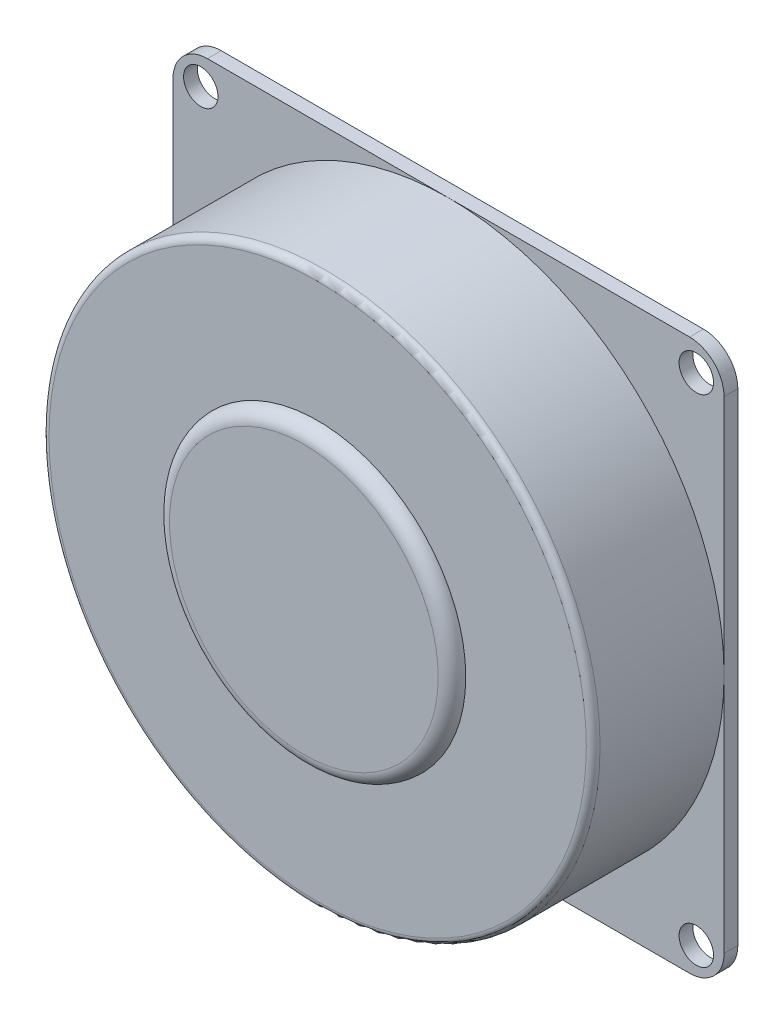
ISO-10303-21;
HEADER;
FILE_DESCRIPTION(('STEP AP214'),'2;1');
FILE_NAME('part.step','',(''),(''),'','','');
FILE_SCHEMA(('AUTOMOTIVE_DESIGN { 1 0 10303 214 1 1 1 1 }'));
ENDSEC;
DATA;
#1=APPLICATION_CONTEXT('core data for automotive mechanical design processes');
#2=APPLICATION_PROTOCOL_DEFINITION('international standard','automotive_design',2000,#1);
#3=PRODUCT_CONTEXT('',#1,'mechanical');
#4=PRODUCT('Part','Part','',(#3));
#5=PRODUCT_RELATED_PRODUCT_CATEGORY('part','',(#4));
#6=PRODUCT_DEFINITION_FORMATION('','',#4);
#7=PRODUCT_DEFINITION_CONTEXT('part definition',#1,'design');
#8=PRODUCT_DEFINITION('design','',#6,#7);
#9=PRODUCT_DEFINITION_SHAPE('','',#8);
#10=(LENGTH_UNIT() NAMED_UNIT(*) SI_UNIT(.MILLI.,.METRE.));
#11=(NAMED_UNIT(*) PLANE_ANGLE_UNIT() SI_UNIT($,.RADIAN.));
#12=(NAMED_UNIT(*) SI_UNIT($,.STERADIAN.) SOLID_ANGLE_UNIT());
#13=UNCERTAINTY_MEASURE_WITH_UNIT(LENGTH_MEASURE(1.E-05),#10,'distance_accuracy_value','');
#14=(GEOMETRIC_REPRESENTATION_CONTEXT(3) GLOBAL_UNCERTAINTY_ASSIGNED_CONTEXT((#13)) GLOBAL_UNIT_ASSIGNED_CONTEXT((#10,
#11,#12)) REPRESENTATION_CONTEXT('',''));
#15=CARTESIAN_POINT('',(0.,0.,0.));
#16=DIRECTION('',(0.,0.,1.));
#17=DIRECTION('',(1.,0.,0.));
#18=AXIS2_PLACEMENT_3D('',#15,#16,#17);
#19=CARTESIAN_POINT('',(0.,0.,2.));
#20=DIRECTION('',(0.,0.,1.));
#21=DIRECTION('',(1.,0.,0.));
#22=AXIS2_PLACEMENT_3D('',#19,#20,#21);
#23=PLANE('',#22);
#24=DIRECTION('',(0.,1.,0.));
#25=VECTOR('',#24,1.);
#26=CARTESIAN_POINT('',(45.6336839540974,33.784355179704,2.));
#27=LINE('',#26,#25);
#28=CARTESIAN_POINT('',(45.6336839540974,-6.21564482029598,2.));
#29=VERTEX_POINT('',#28);
#30=CARTESIAN_POINT('',(45.6336839540974,28.784355179704,2.));
#31=VERTEX_POINT('',#30);
#32=EDGE_CURVE('E141',#29,#31,#27,.T.);
#33=ORIENTED_EDGE('',*,*,#32,.T.);
#34=CARTESIAN_POINT('',(40.6336839540974,28.784355179704,2.));
#35=DIRECTION('',(0.,0.,1.));
#36=DIRECTION('',(1.,0.,0.));
#37=AXIS2_PLACEMENT_3D('',#34,#35,#36);
#38=CIRCLE('',#37,5.);
#39=CARTESIAN_POINT('',(40.6336839540974,33.784355179704,2.));
#40=VERTEX_POINT('',#39);
#41=EDGE_CURVE('E61',#31,#40,#38,.T.);
#42=ORIENTED_EDGE('',*,*,#41,.T.);
#43=DIRECTION('',(-1.,0.,0.));
#44=VECTOR('',#43,1.);
#45=CARTESIAN_POINT('',(-34.3663160459026,33.784355179704,2.));
#46=LINE('',#45,#44);
#47=CARTESIAN_POINT('',(5.63368395409738,33.784355179704,2.));
#48=VERTEX_POINT('',#47);
#49=EDGE_CURVE('E153',#40,#48,#46,.T.);
#50=ORIENTED_EDGE('',*,*,#49,.T.);
#51=CARTESIAN_POINT('',(5.63368395409738,-6.21564482029598,2.));
#52=DIRECTION('',(0.,0.,1.));
#53=DIRECTION('',(1.,0.,0.));
#54=AXIS2_PLACEMENT_3D('',#51,#52,#53);
#55=CIRCLE('',#54,40.);
#56=EDGE_CURVE('E151',#29,#48,#55,.T.);
#57=ORIENTED_EDGE('',*,*,#56,.F.);
#58=EDGE_LOOP('',(#33,#42,#50,#57));
#59=FACE_BOUND('',#58,.T.);
#60=CARTESIAN_POINT('',(41.604922999505,29.784355179704,2.));
#61=DIRECTION('',(0.,0.,1.));
#62=DIRECTION('',(-1.,0.,0.));
#63=AXIS2_PLACEMENT_3D('',#60,#61,#62);
#64=CIRCLE('',#63,2.49999999999999);
#65=CARTESIAN_POINT('',(39.1049229995051,29.784355179704,2.));
#66=VERTEX_POINT('',#65);
#67=EDGE_CURVE('E172',#66,#66,#64,.T.);
#68=ORIENTED_EDGE('',*,*,#67,.F.);
#69=EDGE_LOOP('',(#68));
#70=FACE_BOUND('',#69,.T.);
#71=ADVANCED_FACE('F45',(#59,#70),#23,.T.);
#72=CARTESIAN_POINT('',(-29.3663160459026,33.784355179704,2.));
#73=VERTEX_POINT('',#72);
#74=EDGE_CURVE('E140',#48,#73,#46,.T.);
#75=ORIENTED_EDGE('',*,*,#74,.T.);
#76=CARTESIAN_POINT('',(-29.3663160459026,28.784355179704,2.));
#77=DIRECTION('',(0.,0.,1.));
#78=DIRECTION('',(1.,0.,0.));
#79=AXIS2_PLACEMENT_3D('',#76,#77,#78);
#80=CIRCLE('',#79,5.);
#81=CARTESIAN_POINT('',(-34.3663160459026,28.784355179704,2.));
#82=VERTEX_POINT('',#81);
#83=EDGE_CURVE('E268',#73,#82,#80,.T.);
#84=ORIENTED_EDGE('',*,*,#83,.T.);
#85=DIRECTION('',(0.,-1.,0.));
#86=VECTOR('',#85,1.);
#87=CARTESIAN_POINT('',(-34.3663160459026,33.784355179704,2.));
#88=LINE('',#87,#86);
#89=CARTESIAN_POINT('',(-34.3663160459026,-6.21564482029598,2.));
#90=VERTEX_POINT('',#89);
#91=EDGE_CURVE('E204',#82,#90,#88,.T.);
#92=ORIENTED_EDGE('',*,*,#91,.T.);
#93=EDGE_CURVE('E160',#48,#90,#55,.T.);
#94=ORIENTED_EDGE('',*,*,#93,.F.);
#95=EDGE_LOOP('',(#75,#84,#92,#94));
#96=FACE_BOUND('',#95,.T.);
#97=CARTESIAN_POINT('',(-30.3375550913103,29.784355179704,2.));
#98=DIRECTION('',(0.,0.,1.));
#99=DIRECTION('',(1.,0.,0.));
#100=AXIS2_PLACEMENT_3D('',#97,#98,#99);
#101=CIRCLE('',#100,2.5);
#102=CARTESIAN_POINT('',(-27.8375550913103,29.784355179704,2.));
#103=VERTEX_POINT('',#102);
#104=EDGE_CURVE('E196',#103,#103,#101,.T.);
#105=ORIENTED_EDGE('',*,*,#104,.F.);
#106=EDGE_LOOP('',(#105));
#107=FACE_BOUND('',#106,.T.);
#108=ADVANCED_FACE('F292',(#96,#107),#23,.T.);
#109=CARTESIAN_POINT('',(-34.3663160459026,-41.215644820296,2.));
#110=VERTEX_POINT('',#109);
#111=EDGE_CURVE('E208',#90,#110,#88,.T.);
#112=ORIENTED_EDGE('',*,*,#111,.T.);
#113=CARTESIAN_POINT('',(-29.3663160459026,-41.215644820296,2.));
#114=DIRECTION('',(0.,0.,1.));
#115=DIRECTION('',(1.,0.,0.));
#116=AXIS2_PLACEMENT_3D('',#113,#114,#115);
#117=CIRCLE('',#116,5.);
#118=CARTESIAN_POINT('',(-29.3663160459026,-46.215644820296,2.));
#119=VERTEX_POINT('',#118);
#120=EDGE_CURVE('E257',#110,#119,#117,.T.);
#121=ORIENTED_EDGE('',*,*,#120,.T.);
#122=DIRECTION('',(1.,0.,0.));
#123=VECTOR('',#122,1.);
#124=CARTESIAN_POINT('',(-34.3663160459026,-46.215644820296,2.));
#125=LINE('',#124,#123);
#126=CARTESIAN_POINT('',(5.63368395409738,-46.215644820296,2.));
#127=VERTEX_POINT('',#126);
#128=EDGE_CURVE('E149',#119,#127,#125,.T.);
#129=ORIENTED_EDGE('',*,*,#128,.T.);
#130=EDGE_CURVE('E164',#90,#127,#55,.T.);
#131=ORIENTED_EDGE('',*,*,#130,.F.);
#132=EDGE_LOOP('',(#112,#121,#129,#131));
#133=FACE_BOUND('',#132,.T.);
#134=CARTESIAN_POINT('',(-30.3375550913103,-42.215644820296,2.));
#135=DIRECTION('',(0.,0.,1.));
#136=DIRECTION('',(1.,0.,0.));
#137=AXIS2_PLACEMENT_3D('',#134,#135,#136);
#138=CIRCLE('',#137,2.5);
#139=CARTESIAN_POINT('',(-27.8375550913103,-42.215644820296,2.));
#140=VERTEX_POINT('',#139);
#141=EDGE_CURVE('E180',#140,#140,#138,.T.);
#142=ORIENTED_EDGE('',*,*,#141,.F.);
#143=EDGE_LOOP('',(#142));
#144=FACE_BOUND('',#143,.T.);
#145=ADVANCED_FACE('F298',(#133,#144),#23,.T.);
#146=CARTESIAN_POINT('',(40.6336839540974,-46.215644820296,2.));
#147=VERTEX_POINT('',#146);
#148=EDGE_CURVE('E207',#127,#147,#125,.T.);
#149=ORIENTED_EDGE('',*,*,#148,.T.);
#150=CARTESIAN_POINT('',(40.6336839540974,-41.215644820296,2.));
#151=DIRECTION('',(0.,0.,1.));
#152=DIRECTION('',(1.,0.,0.));
#153=AXIS2_PLACEMENT_3D('',#150,#151,#152);
#154=CIRCLE('',#153,5.);
#155=CARTESIAN_POINT('',(45.6336839540974,-41.215644820296,2.));
#156=VERTEX_POINT('',#155);
#157=EDGE_CURVE('E135',#147,#156,#154,.T.);
#158=ORIENTED_EDGE('',*,*,#157,.T.);
#159=EDGE_CURVE('E126',#156,#29,#27,.T.);
#160=ORIENTED_EDGE('',*,*,#159,.T.);
#161=EDGE_CURVE('E132',#127,#29,#55,.T.);
#162=ORIENTED_EDGE('',*,*,#161,.F.);
#163=EDGE_LOOP('',(#149,#158,#160,#162));
#164=FACE_BOUND('',#163,.T.);
#165=CARTESIAN_POINT('',(41.6049229995051,-42.215644820296,2.));
#166=DIRECTION('',(0.,0.,1.));
#167=DIRECTION('',(-1.,0.,0.));
#168=AXIS2_PLACEMENT_3D('',#165,#166,#167);
#169=CIRCLE('',#168,2.5);
#170=CARTESIAN_POINT('',(39.1049229995051,-42.215644820296,2.));
#171=VERTEX_POINT('',#170);
#172=EDGE_CURVE('E188',#171,#171,#169,.T.);
#173=ORIENTED_EDGE('',*,*,#172,.F.);
#174=EDGE_LOOP('',(#173));
#175=FACE_BOUND('',#174,.T.);
#176=ADVANCED_FACE('F129',(#164,#175),#23,.T.);
#177=CARTESIAN_POINT('',(0.,0.,0.));
#178=DIRECTION('',(0.,0.,1.));
#179=DIRECTION('',(1.,0.,0.));
#180=AXIS2_PLACEMENT_3D('',#177,#178,#179);
#181=PLANE('',#180);
#182=DIRECTION('',(0.,1.,0.));
#183=VECTOR('',#182,1.);
#184=CARTESIAN_POINT('',(45.6336839540974,33.784355179704,0.));
#185=LINE('',#184,#183);
#186=CARTESIAN_POINT('',(45.6336839540974,-41.215644820296,0.));
#187=VERTEX_POINT('',#186);
#188=CARTESIAN_POINT('',(45.6336839540974,28.784355179704,0.));
#189=VERTEX_POINT('',#188);
#190=EDGE_CURVE('E218',#187,#189,#185,.T.);
#191=ORIENTED_EDGE('',*,*,#190,.F.);
#192=CARTESIAN_POINT('',(40.6336839540974,-41.215644820296,0.));
#193=DIRECTION('',(0.,0.,1.));
#194=DIRECTION('',(1.,0.,0.));
#195=AXIS2_PLACEMENT_3D('',#192,#193,#194);
#196=CIRCLE('',#195,5.);
#197=CARTESIAN_POINT('',(40.6336839540974,-46.215644820296,0.));
#198=VERTEX_POINT('',#197);
#199=EDGE_CURVE('E238',#187,#198,#196,.F.);
#200=ORIENTED_EDGE('',*,*,#199,.T.);
#201=DIRECTION('',(1.,0.,0.));
#202=VECTOR('',#201,1.);
#203=CARTESIAN_POINT('',(-34.3663160459026,-46.215644820296,0.));
#204=LINE('',#203,#202);
#205=CARTESIAN_POINT('',(-29.3663160459026,-46.215644820296,0.));
#206=VERTEX_POINT('',#205);
#207=EDGE_CURVE('E214',#206,#198,#204,.T.);
#208=ORIENTED_EDGE('',*,*,#207,.F.);
#209=CARTESIAN_POINT('',(-29.3663160459026,-41.215644820296,0.));
#210=DIRECTION('',(0.,0.,1.));
#211=DIRECTION('',(1.,0.,0.));
#212=AXIS2_PLACEMENT_3D('',#209,#210,#211);
#213=CIRCLE('',#212,5.);
#214=CARTESIAN_POINT('',(-34.3663160459026,-41.215644820296,0.));
#215=VERTEX_POINT('',#214);
#216=EDGE_CURVE('E235',#206,#215,#213,.F.);
#217=ORIENTED_EDGE('',*,*,#216,.T.);
#218=DIRECTION('',(0.,-1.,0.));
#219=VECTOR('',#218,1.);
#220=CARTESIAN_POINT('',(-34.3663160459026,33.784355179704,0.));
#221=LINE('',#220,#219);
#222=CARTESIAN_POINT('',(-34.3663160459026,28.784355179704,0.));
#223=VERTEX_POINT('',#222);
#224=EDGE_CURVE('E200',#223,#215,#221,.T.);
#225=ORIENTED_EDGE('',*,*,#224,.F.);
#226=CARTESIAN_POINT('',(-29.3663160459026,28.784355179704,0.));
#227=DIRECTION('',(0.,0.,1.));
#228=DIRECTION('',(1.,0.,0.));
#229=AXIS2_PLACEMENT_3D('',#226,#227,#228);
#230=CIRCLE('',#229,5.);
#231=CARTESIAN_POINT('',(-29.3663160459026,33.784355179704,0.));
#232=VERTEX_POINT('',#231);
#233=EDGE_CURVE('E229',#223,#232,#230,.F.);
#234=ORIENTED_EDGE('',*,*,#233,.T.);
#235=DIRECTION('',(-1.,0.,0.));
#236=VECTOR('',#235,1.);
#237=CARTESIAN_POINT('',(-34.3663160459026,33.784355179704,0.));
#238=LINE('',#237,#236);
#239=CARTESIAN_POINT('',(40.6336839540974,33.784355179704,0.));
#240=VERTEX_POINT('',#239);
#241=EDGE_CURVE('E221',#240,#232,#238,.T.);
#242=ORIENTED_EDGE('',*,*,#241,.F.);
#243=CARTESIAN_POINT('',(40.6336839540974,28.784355179704,0.));
#244=DIRECTION('',(0.,0.,1.));
#245=DIRECTION('',(1.,0.,0.));
#246=AXIS2_PLACEMENT_3D('',#243,#244,#245);
#247=CIRCLE('',#246,5.);
#248=EDGE_CURVE('E232',#240,#189,#247,.F.);
#249=ORIENTED_EDGE('',*,*,#248,.T.);
#250=EDGE_LOOP('',(#191,#200,#208,#217,#225,#234,#242,#249));
#251=FACE_BOUND('',#250,.T.);
#252=CARTESIAN_POINT('',(-30.3375550913103,29.784355179704,0.));
#253=DIRECTION('',(0.,0.,1.));
#254=DIRECTION('',(1.,0.,0.));
#255=AXIS2_PLACEMENT_3D('',#252,#253,#254);
#256=CIRCLE('',#255,2.5);
#257=CARTESIAN_POINT('',(-27.8375550913103,29.784355179704,0.));
#258=VERTEX_POINT('',#257);
#259=EDGE_CURVE('E192',#258,#258,#256,.T.);
#260=ORIENTED_EDGE('',*,*,#259,.T.);
#261=EDGE_LOOP('',(#260));
#262=FACE_BOUND('',#261,.T.);
#263=CARTESIAN_POINT('',(41.6049229995051,-42.215644820296,0.));
#264=DIRECTION('',(0.,0.,1.));
#265=DIRECTION('',(-1.,0.,0.));
#266=AXIS2_PLACEMENT_3D('',#263,#264,#265);
#267=CIRCLE('',#266,2.5);
#268=CARTESIAN_POINT('',(39.1049229995051,-42.215644820296,0.));
#269=VERTEX_POINT('',#268);
#270=EDGE_CURVE('E184',#269,#269,#267,.T.);
#271=ORIENTED_EDGE('',*,*,#270,.T.);
#272=EDGE_LOOP('',(#271));
#273=FACE_BOUND('',#272,.T.);
#274=CARTESIAN_POINT('',(-30.3375550913103,-42.215644820296,0.));
#275=DIRECTION('',(0.,0.,1.));
#276=DIRECTION('',(1.,0.,0.));
#277=AXIS2_PLACEMENT_3D('',#274,#275,#276);
#278=CIRCLE('',#277,2.5);
#279=CARTESIAN_POINT('',(-27.8375550913103,-42.215644820296,0.));
#280=VERTEX_POINT('',#279);
#281=EDGE_CURVE('E176',#280,#280,#278,.T.);
#282=ORIENTED_EDGE('',*,*,#281,.T.);
#283=EDGE_LOOP('',(#282));
#284=FACE_BOUND('',#283,.T.);
#285=CARTESIAN_POINT('',(41.604922999505,29.784355179704,0.));
#286=DIRECTION('',(0.,0.,1.));
#287=DIRECTION('',(-1.,0.,0.));
#288=AXIS2_PLACEMENT_3D('',#285,#286,#287);
#289=CIRCLE('',#288,2.49999999999999);
#290=CARTESIAN_POINT('',(39.1049229995051,29.784355179704,0.));
#291=VERTEX_POINT('',#290);
#292=EDGE_CURVE('E158',#291,#291,#289,.T.);
#293=ORIENTED_EDGE('',*,*,#292,.T.);
#294=EDGE_LOOP('',(#293));
#295=FACE_BOUND('',#294,.T.);
#296=ADVANCED_FACE('F303',(#251,#262,#273,#284,#295),#181,.F.);
#297=CARTESIAN_POINT('',(-34.3663160459026,33.784355179704,2.));
#298=DIRECTION('',(1.,0.,0.));
#299=DIRECTION('',(0.,0.,-1.));
#300=AXIS2_PLACEMENT_3D('',#297,#298,#299);
#301=PLANE('',#300);
#302=ORIENTED_EDGE('',*,*,#224,.T.);
#303=DIRECTION('',(0.,0.,-1.));
#304=VECTOR('',#303,1.);
#305=CARTESIAN_POINT('',(-34.3663160459026,-41.215644820296,2.));
#306=LINE('',#305,#304);
#307=EDGE_CURVE('E254',#215,#110,#306,.F.);
#308=ORIENTED_EDGE('',*,*,#307,.T.);
#309=ORIENTED_EDGE('',*,*,#111,.F.);
#310=ORIENTED_EDGE('',*,*,#91,.F.);
#311=DIRECTION('',(0.,0.,-1.));
#312=VECTOR('',#311,1.);
#313=CARTESIAN_POINT('',(-34.3663160459026,28.784355179704,2.));
#314=LINE('',#313,#312);
#315=EDGE_CURVE('E250',#82,#223,#314,.T.);
#316=ORIENTED_EDGE('',*,*,#315,.T.);
#317=EDGE_LOOP('',(#302,#308,#309,#310,#316));
#318=FACE_BOUND('',#317,.T.);
#319=ADVANCED_FACE('F308',(#318),#301,.F.);
#320=CARTESIAN_POINT('',(-34.3663160459026,-46.215644820296,2.));
#321=DIRECTION('',(0.,1.,0.));
#322=DIRECTION('',(0.,0.,1.));
#323=AXIS2_PLACEMENT_3D('',#320,#321,#322);
#324=PLANE('',#323);
#325=ORIENTED_EDGE('',*,*,#207,.T.);
#326=DIRECTION('',(0.,0.,-1.));
#327=VECTOR('',#326,1.);
#328=CARTESIAN_POINT('',(40.6336839540974,-46.215644820296,2.));
#329=LINE('',#328,#327);
#330=EDGE_CURVE('E245',#198,#147,#329,.F.);
#331=ORIENTED_EDGE('',*,*,#330,.T.);
#332=ORIENTED_EDGE('',*,*,#148,.F.);
#333=ORIENTED_EDGE('',*,*,#128,.F.);
#334=DIRECTION('',(0.,0.,-1.));
#335=VECTOR('',#334,1.);
#336=CARTESIAN_POINT('',(-29.3663160459026,-46.215644820296,2.));
#337=LINE('',#336,#335);
#338=EDGE_CURVE('E241',#119,#206,#337,.T.);
#339=ORIENTED_EDGE('',*,*,#338,.T.);
#340=EDGE_LOOP('',(#325,#331,#332,#333,#339));
#341=FACE_BOUND('',#340,.T.);
#342=ADVANCED_FACE('F361',(#341),#324,.F.);
#343=CARTESIAN_POINT('',(45.6336839540974,33.784355179704,2.));
#344=DIRECTION('',(-1.,0.,0.));
#345=DIRECTION('',(0.,-1.,0.));
#346=AXIS2_PLACEMENT_3D('',#343,#344,#345);
#347=PLANE('',#346);
#348=ORIENTED_EDGE('',*,*,#159,.F.);
#349=DIRECTION('',(0.,0.,-1.));
#350=VECTOR('',#349,1.);
#351=CARTESIAN_POINT('',(45.6336839540974,-41.215644820296,2.));
#352=LINE('',#351,#350);
#353=EDGE_CURVE('E226',#156,#187,#352,.T.);
#354=ORIENTED_EDGE('',*,*,#353,.T.);
#355=ORIENTED_EDGE('',*,*,#190,.T.);
#356=DIRECTION('',(0.,0.,-1.));
#357=VECTOR('',#356,1.);
#358=CARTESIAN_POINT('',(45.6336839540974,28.784355179704,2.));
#359=LINE('',#358,#357);
#360=EDGE_CURVE('E147',#189,#31,#359,.F.);
#361=ORIENTED_EDGE('',*,*,#360,.T.);
#362=ORIENTED_EDGE('',*,*,#32,.F.);
#363=EDGE_LOOP('',(#348,#354,#355,#361,#362));
#364=FACE_BOUND('',#363,.T.);
#365=ADVANCED_FACE('F144',(#364),#347,.F.);
#366=CARTESIAN_POINT('',(-34.3663160459026,33.784355179704,2.));
#367=DIRECTION('',(0.,-1.,0.));
#368=DIRECTION('',(0.,0.,-1.));
#369=AXIS2_PLACEMENT_3D('',#366,#367,#368);
#370=PLANE('',#369);
#371=ORIENTED_EDGE('',*,*,#49,.F.);
#372=DIRECTION('',(0.,0.,-1.));
#373=VECTOR('',#372,1.);
#374=CARTESIAN_POINT('',(40.6336839540974,33.784355179704,2.));
#375=LINE('',#374,#373);
#376=EDGE_CURVE('E262',#40,#240,#375,.T.);
#377=ORIENTED_EDGE('',*,*,#376,.T.);
#378=ORIENTED_EDGE('',*,*,#241,.T.);
#379=DIRECTION('',(0.,0.,-1.));
#380=VECTOR('',#379,1.);
#381=CARTESIAN_POINT('',(-29.3663160459026,33.784355179704,2.));
#382=LINE('',#381,#380);
#383=EDGE_CURVE('E69',#232,#73,#382,.F.);
#384=ORIENTED_EDGE('',*,*,#383,.T.);
#385=ORIENTED_EDGE('',*,*,#74,.F.);
#386=EDGE_LOOP('',(#371,#377,#378,#384,#385));
#387=FACE_BOUND('',#386,.T.);
#388=ADVANCED_FACE('F343',(#387),#370,.F.);
#389=CARTESIAN_POINT('',(-30.3375550913103,29.784355179704,2.));
#390=DIRECTION('',(0.,0.,-1.));
#391=DIRECTION('',(-1.,0.,0.));
#392=AXIS2_PLACEMENT_3D('',#389,#390,#391);
#393=CYLINDRICAL_SURFACE('',#392,2.5);
#394=ORIENTED_EDGE('',*,*,#104,.T.);
#395=EDGE_LOOP('',(#394));
#396=FACE_BOUND('',#395,.T.);
#397=ORIENTED_EDGE('',*,*,#259,.F.);
#398=EDGE_LOOP('',(#397));
#399=FACE_BOUND('',#398,.T.);
#400=ADVANCED_FACE('F340',(#396,#399),#393,.F.);
#401=CARTESIAN_POINT('',(41.6049229995051,-42.215644820296,2.));
#402=DIRECTION('',(0.,0.,-1.));
#403=DIRECTION('',(-1.,0.,0.));
#404=AXIS2_PLACEMENT_3D('',#401,#402,#403);
#405=CYLINDRICAL_SURFACE('',#404,2.5);
#406=ORIENTED_EDGE('',*,*,#172,.T.);
#407=EDGE_LOOP('',(#406));
#408=FACE_BOUND('',#407,.T.);
#409=ORIENTED_EDGE('',*,*,#270,.F.);
#410=EDGE_LOOP('',(#409));
#411=FACE_BOUND('',#410,.T.);
#412=ADVANCED_FACE('F323',(#408,#411),#405,.F.);
#413=CARTESIAN_POINT('',(-30.3375550913103,-42.215644820296,2.));
#414=DIRECTION('',(0.,0.,-1.));
#415=DIRECTION('',(-1.,0.,0.));
#416=AXIS2_PLACEMENT_3D('',#413,#414,#415);
#417=CYLINDRICAL_SURFACE('',#416,2.5);
#418=ORIENTED_EDGE('',*,*,#141,.T.);
#419=EDGE_LOOP('',(#418));
#420=FACE_BOUND('',#419,.T.);
#421=ORIENTED_EDGE('',*,*,#281,.F.);
#422=EDGE_LOOP('',(#421));
#423=FACE_BOUND('',#422,.T.);
#424=ADVANCED_FACE('F319',(#420,#423),#417,.F.);
#425=CARTESIAN_POINT('',(41.604922999505,29.784355179704,2.));
#426=DIRECTION('',(0.,0.,-1.));
#427=DIRECTION('',(-1.,0.,0.));
#428=AXIS2_PLACEMENT_3D('',#425,#426,#427);
#429=CYLINDRICAL_SURFACE('',#428,2.49999999999999);
#430=ORIENTED_EDGE('',*,*,#67,.T.);
#431=EDGE_LOOP('',(#430));
#432=FACE_BOUND('',#431,.T.);
#433=ORIENTED_EDGE('',*,*,#292,.F.);
#434=EDGE_LOOP('',(#433));
#435=FACE_BOUND('',#434,.T.);
#436=ADVANCED_FACE('F322',(#432,#435),#429,.F.);
#437=CARTESIAN_POINT('',(5.63368395409738,-6.21564482029598,21.));
#438=DIRECTION('',(0.,0.,-1.));
#439=DIRECTION('',(-1.,0.,0.));
#440=AXIS2_PLACEMENT_3D('',#437,#438,#439);
#441=CYLINDRICAL_SURFACE('',#440,40.);
#442=CARTESIAN_POINT('',(5.63368395409738,-6.21564482029598,20.));
#443=DIRECTION('',(0.,0.,1.));
#444=DIRECTION('',(1.,0.,0.));
#445=AXIS2_PLACEMENT_3D('',#442,#443,#444);
#446=CIRCLE('',#445,40.);
#447=CARTESIAN_POINT('',(45.6336839540974,-6.21564482029598,20.));
#448=VERTEX_POINT('',#447);
#449=EDGE_CURVE('E11',#448,#448,#446,.F.);
#450=ORIENTED_EDGE('',*,*,#449,.T.);
#451=EDGE_LOOP('',(#450));
#452=FACE_BOUND('',#451,.T.);
#453=ORIENTED_EDGE('',*,*,#56,.T.);
#454=ORIENTED_EDGE('',*,*,#93,.T.);
#455=ORIENTED_EDGE('',*,*,#130,.T.);
#456=ORIENTED_EDGE('',*,*,#161,.T.);
#457=EDGE_LOOP('',(#453,#454,#455,#456));
#458=FACE_BOUND('',#457,.T.);
#459=ADVANCED_FACE('F162',(#452,#458),#441,.T.);
#460=CARTESIAN_POINT('',(5.63368395409738,-6.21564482029598,21.));
#461=DIRECTION('',(0.,0.,1.));
#462=DIRECTION('',(1.,0.,0.));
#463=AXIS2_PLACEMENT_3D('',#460,#461,#462);
#464=PLANE('',#463);
#465=CARTESIAN_POINT('',(5.63368395409738,-6.21564482029598,21.));
#466=DIRECTION('',(0.,0.,1.));
#467=DIRECTION('',(1.,0.,0.));
#468=AXIS2_PLACEMENT_3D('',#465,#466,#467);
#469=CIRCLE('',#468,39.);
#470=CARTESIAN_POINT('',(44.6336839540974,-6.21564482029598,21.));
#471=VERTEX_POINT('',#470);
#472=EDGE_CURVE('E54',#471,#471,#469,.T.);
#473=ORIENTED_EDGE('',*,*,#472,.T.);
#474=EDGE_LOOP('',(#473));
#475=FACE_BOUND('',#474,.T.);
#476=CARTESIAN_POINT('',(5.63368395409738,-6.21564482029598,21.));
#477=DIRECTION('',(0.,0.,1.));
#478=DIRECTION('',(1.,0.,0.));
#479=AXIS2_PLACEMENT_3D('',#476,#477,#478);
#480=CIRCLE('',#479,21.5);
#481=CARTESIAN_POINT('',(27.1336839540974,-6.21564482029598,21.));
#482=VERTEX_POINT('',#481);
#483=EDGE_CURVE('E171',#482,#482,#480,.T.);
#484=ORIENTED_EDGE('',*,*,#483,.F.);
#485=EDGE_LOOP('',(#484));
#486=FACE_BOUND('',#485,.T.);
#487=ADVANCED_FACE('F278',(#475,#486),#464,.T.);
#488=CARTESIAN_POINT('',(5.63368395409738,-6.21564482029598,23.));
#489=DIRECTION('',(0.,0.,1.));
#490=DIRECTION('',(1.,0.,0.));
#491=AXIS2_PLACEMENT_3D('',#488,#489,#490);
#492=PLANE('',#491);
#493=CARTESIAN_POINT('',(5.63368395409738,-6.21564482029598,23.));
#494=DIRECTION('',(0.,0.,1.));
#495=DIRECTION('',(1.,0.,0.));
#496=AXIS2_PLACEMENT_3D('',#493,#494,#495);
#497=CIRCLE('',#496,19.5);
#498=CARTESIAN_POINT('',(25.1336839540974,-6.21564482029598,23.));
#499=VERTEX_POINT('',#498);
#500=EDGE_CURVE('E271',#499,#499,#497,.T.);
#501=ORIENTED_EDGE('',*,*,#500,.T.);
#502=EDGE_LOOP('',(#501));
#503=FACE_BOUND('',#502,.T.);
#504=ADVANCED_FACE('F373',(#503),#492,.T.);
#505=CARTESIAN_POINT('',(40.6336839540974,-41.215644820296,2.));
#506=DIRECTION('',(0.,0.,-1.));
#507=DIRECTION('',(-1.,0.,0.));
#508=AXIS2_PLACEMENT_3D('',#505,#506,#507);
#509=CYLINDRICAL_SURFACE('',#508,5.);
#510=ORIENTED_EDGE('',*,*,#157,.F.);
#511=ORIENTED_EDGE('',*,*,#330,.F.);
#512=ORIENTED_EDGE('',*,*,#199,.F.);
#513=ORIENTED_EDGE('',*,*,#353,.F.);
#514=EDGE_LOOP('',(#510,#511,#512,#513));
#515=FACE_BOUND('',#514,.T.);
#516=ADVANCED_FACE('F370',(#515),#509,.T.);
#517=CARTESIAN_POINT('',(-29.3663160459026,-41.215644820296,2.));
#518=DIRECTION('',(0.,0.,-1.));
#519=DIRECTION('',(-1.,0.,0.));
#520=AXIS2_PLACEMENT_3D('',#517,#518,#519);
#521=CYLINDRICAL_SURFACE('',#520,5.);
#522=ORIENTED_EDGE('',*,*,#120,.F.);
#523=ORIENTED_EDGE('',*,*,#307,.F.);
#524=ORIENTED_EDGE('',*,*,#216,.F.);
#525=ORIENTED_EDGE('',*,*,#338,.F.);
#526=EDGE_LOOP('',(#522,#523,#524,#525));
#527=FACE_BOUND('',#526,.T.);
#528=ADVANCED_FACE('F372',(#527),#521,.T.);
#529=CARTESIAN_POINT('',(40.6336839540974,28.784355179704,2.));
#530=DIRECTION('',(0.,0.,-1.));
#531=DIRECTION('',(-1.,0.,0.));
#532=AXIS2_PLACEMENT_3D('',#529,#530,#531);
#533=CYLINDRICAL_SURFACE('',#532,5.);
#534=ORIENTED_EDGE('',*,*,#41,.F.);
#535=ORIENTED_EDGE('',*,*,#360,.F.);
#536=ORIENTED_EDGE('',*,*,#248,.F.);
#537=ORIENTED_EDGE('',*,*,#376,.F.);
#538=EDGE_LOOP('',(#534,#535,#536,#537));
#539=FACE_BOUND('',#538,.T.);
#540=ADVANCED_FACE('F377',(#539),#533,.T.);
#541=CARTESIAN_POINT('',(-29.3663160459026,28.784355179704,2.));
#542=DIRECTION('',(0.,0.,-1.));
#543=DIRECTION('',(-1.,0.,0.));
#544=AXIS2_PLACEMENT_3D('',#541,#542,#543);
#545=CYLINDRICAL_SURFACE('',#544,5.);
#546=ORIENTED_EDGE('',*,*,#83,.F.);
#547=ORIENTED_EDGE('',*,*,#383,.F.);
#548=ORIENTED_EDGE('',*,*,#233,.F.);
#549=ORIENTED_EDGE('',*,*,#315,.F.);
#550=EDGE_LOOP('',(#546,#547,#548,#549));
#551=FACE_BOUND('',#550,.T.);
#552=ADVANCED_FACE('F288',(#551),#545,.T.);
#553=CARTESIAN_POINT('',(5.63368395409738,-6.21564482029598,21.));
#554=DIRECTION('',(0.,0.,1.));
#555=DIRECTION('',(1.,0.,0.));
#556=AXIS2_PLACEMENT_3D('',#553,#554,#555);
#557=TOROIDAL_SURFACE('',#556,19.5,2.);
#558=ORIENTED_EDGE('',*,*,#483,.T.);
#559=EDGE_LOOP('',(#558));
#560=FACE_BOUND('',#559,.T.);
#561=ORIENTED_EDGE('',*,*,#500,.F.);
#562=EDGE_LOOP('',(#561));
#563=FACE_BOUND('',#562,.T.);
#564=ADVANCED_FACE('F282',(#560,#563),#557,.T.);
#565=CARTESIAN_POINT('',(5.63368395409738,-6.21564482029598,20.));
#566=DIRECTION('',(0.,0.,1.));
#567=DIRECTION('',(1.,0.,0.));
#568=AXIS2_PLACEMENT_3D('',#565,#566,#567);
#569=TOROIDAL_SURFACE('',#568,39.,1.);
#570=ORIENTED_EDGE('',*,*,#449,.F.);
#571=EDGE_LOOP('',(#570));
#572=FACE_BOUND('',#571,.T.);
#573=ORIENTED_EDGE('',*,*,#472,.F.);
#574=EDGE_LOOP('',(#573));
#575=FACE_BOUND('',#574,.T.);
#576=ADVANCED_FACE('F47',(#572,#575),#569,.T.);
#577=CLOSED_SHELL('',(#71,#108,#145,#176,#296,#319,#342,#365,#388,#400,#412,#424,#436,#459,#487,
#504,#516,#528,#540,#552,#564,#576));
#578=MANIFOLD_SOLID_BREP('B2',#577);
#579=ADVANCED_BREP_SHAPE_REPRESENTATION('',(#18,#578),#14);
#580=SHAPE_DEFINITION_REPRESENTATION(#9,#579);
ENDSEC;
END-ISO-10303-21;
